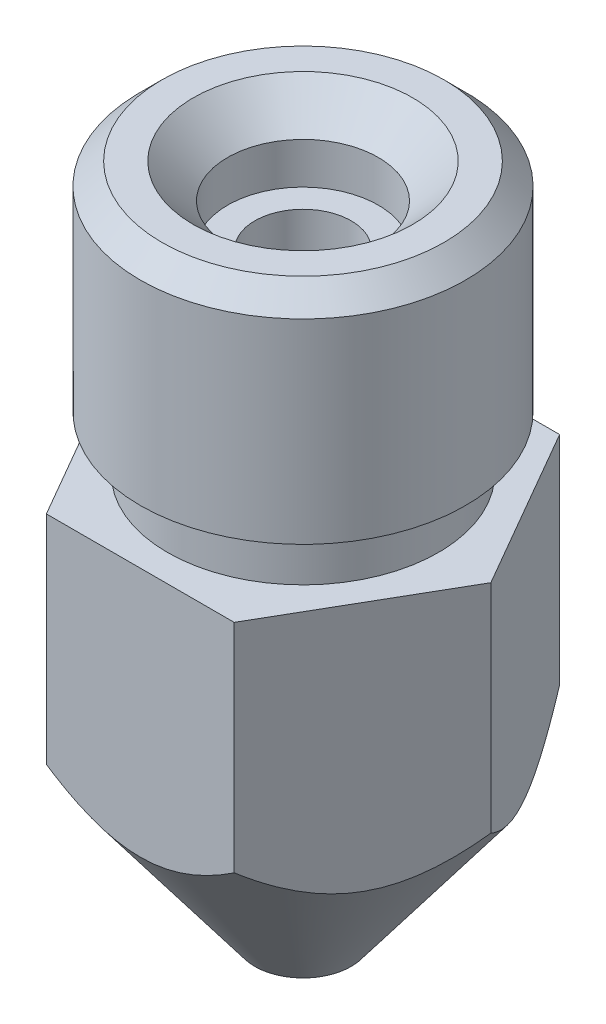
ISO-10303-21;
HEADER;
FILE_DESCRIPTION(('STEP AP214'),'2;1');
FILE_NAME('part.step','',(''),(''),'','','');
FILE_SCHEMA(('AUTOMOTIVE_DESIGN { 1 0 10303 214 1 1 1 1 }'));
ENDSEC;
DATA;
#1=APPLICATION_CONTEXT('core data for automotive mechanical design processes');
#2=APPLICATION_PROTOCOL_DEFINITION('international standard','automotive_design',2000,#1);
#3=PRODUCT_CONTEXT('',#1,'mechanical');
#4=PRODUCT('Part','Part','',(#3));
#5=PRODUCT_RELATED_PRODUCT_CATEGORY('part','',(#4));
#6=PRODUCT_DEFINITION_FORMATION('','',#4);
#7=PRODUCT_DEFINITION_CONTEXT('part definition',#1,'design');
#8=PRODUCT_DEFINITION('design','',#6,#7);
#9=PRODUCT_DEFINITION_SHAPE('','',#8);
#10=(LENGTH_UNIT() NAMED_UNIT(*) SI_UNIT(.MILLI.,.METRE.));
#11=(NAMED_UNIT(*) PLANE_ANGLE_UNIT() SI_UNIT($,.RADIAN.));
#12=(NAMED_UNIT(*) SI_UNIT($,.STERADIAN.) SOLID_ANGLE_UNIT());
#13=UNCERTAINTY_MEASURE_WITH_UNIT(LENGTH_MEASURE(1.E-05),#10,'distance_accuracy_value','');
#14=(GEOMETRIC_REPRESENTATION_CONTEXT(3) GLOBAL_UNCERTAINTY_ASSIGNED_CONTEXT((#13)) GLOBAL_UNIT_ASSIGNED_CONTEXT((#10,
#11,#12)) REPRESENTATION_CONTEXT('',''));
#15=CARTESIAN_POINT('',(0.,0.,0.));
#16=DIRECTION('',(0.,0.,1.));
#17=DIRECTION('',(1.,0.,0.));
#18=AXIS2_PLACEMENT_3D('',#15,#16,#17);
#19=CARTESIAN_POINT('',(-1.73205080756888,8.,-3.));
#20=DIRECTION('',(0.,0.,-1.));
#21=DIRECTION('',(-1.,0.,0.));
#22=AXIS2_PLACEMENT_3D('',#19,#20,#21);
#23=PLANE('',#22);
#24=DIRECTION('',(0.,-1.,0.));
#25=VECTOR('',#24,1.);
#26=CARTESIAN_POINT('',(1.73205080756888,8.,-3.));
#27=LINE('',#26,#25);
#28=CARTESIAN_POINT('',(1.73205080756888,8.,-3.));
#29=VERTEX_POINT('',#28);
#30=CARTESIAN_POINT('',(1.73205080756888,4.,-3.));
#31=VERTEX_POINT('',#30);
#32=EDGE_CURVE('E121',#29,#31,#27,.T.);
#33=ORIENTED_EDGE('',*,*,#32,.T.);
#34=CARTESIAN_POINT('',(6.82094997114173,9.29170262212918,-3.));
#35=CARTESIAN_POINT('',(6.64774401929554,9.0813350452875,-3.));
#36=CARTESIAN_POINT('',(6.47393682047476,8.87145715706887,-3.));
#37=CARTESIAN_POINT('',(6.12470232744338,8.45299574589398,-3.));
#38=CARTESIAN_POINT('',(5.94927477059046,8.24441244227294,-3.));
#39=CARTESIAN_POINT('',(5.59514693124846,7.82740350788611,-3.));
#40=CARTESIAN_POINT('',(5.41643208998841,7.61899021794126,-3.));
#41=CARTESIAN_POINT('',(5.05642425576579,7.20443416468754,-3.));
#42=CARTESIAN_POINT('',(4.87513153134106,6.9982911687951,-3.));
#43=CARTESIAN_POINT('',(4.5090672090941,6.58899526887859,-3.));
#44=CARTESIAN_POINT('',(4.3242945460733,6.38584331545606,-3.));
#45=CARTESIAN_POINT('',(3.95005740804673,5.98375586759388,-3.));
#46=CARTESIAN_POINT('',(3.76059151249946,5.78482168444988,-3.));
#47=CARTESIAN_POINT('',(3.47184219550872,5.4915442923644,-3.));
#48=CARTESIAN_POINT('',(3.37500105089817,5.394797923562,-3.));
#49=CARTESIAN_POINT('',(3.1793727340827,5.20329677499139,-3.));
#50=CARTESIAN_POINT('',(3.08058566421516,5.10854189102863,-3.));
#51=CARTESIAN_POINT('',(2.88070893905753,4.921586846251,-3.));
#52=CARTESIAN_POINT('',(2.77962046353045,4.82938542789815,-3.));
#53=CARTESIAN_POINT('',(2.57459260084723,4.64822018956895,-3.));
#54=CARTESIAN_POINT('',(2.47065366985406,4.55925585679777,-3.));
#55=CARTESIAN_POINT('',(2.28862234726129,4.4097050632151,-3.));
#56=CARTESIAN_POINT('',(2.21136888640864,4.34809943254844,-3.));
#57=CARTESIAN_POINT('',(2.05473140880651,4.22764137904479,-3.));
#58=CARTESIAN_POINT('',(1.9753473475123,4.16878901384134,-3.));
#59=CARTESIAN_POINT('',(1.81387586263798,4.05436049626195,-3.));
#60=CARTESIAN_POINT('',(1.73178097960948,3.99879480635185,-3.));
#61=CARTESIAN_POINT('',(1.56475441110359,3.89205838750722,-3.));
#62=CARTESIAN_POINT('',(1.47982257937978,3.84088788563444,-3.));
#63=CARTESIAN_POINT('',(1.30512148999752,3.74322948768255,-3.));
#64=CARTESIAN_POINT('',(1.21529060012066,3.69685062713399,-3.));
#65=CARTESIAN_POINT('',(1.03208329206091,3.61157078096566,-3.));
#66=CARTESIAN_POINT('',(0.93870650560269,3.57267057463351,-3.));
#67=CARTESIAN_POINT('',(0.749050629815442,3.50454058292605,-3.));
#68=CARTESIAN_POINT('',(0.652791806198183,3.47525534555795,-3.));
#69=CARTESIAN_POINT('',(0.457520364679528,3.42811907293071,-3.));
#70=CARTESIAN_POINT('',(0.358510342286855,3.41025761855338,-3.));
#71=CARTESIAN_POINT('',(0.19129661209742,3.39117694677446,-3.));
#72=CARTESIAN_POINT('',(0.123482172493176,3.38644420413247,-3.));
#73=CARTESIAN_POINT('',(-0.0122925148994382,3.38310881608497,-3.));
#74=CARTESIAN_POINT('',(-0.080252730712024,3.3845049412508,-3.));
#75=CARTESIAN_POINT('',(-0.215790868233687,3.39336746728049,-3.));
#76=CARTESIAN_POINT('',(-0.283368668280889,3.40083570139529,-3.));
#77=CARTESIAN_POINT('',(-0.417639206399825,3.42151185906388,-3.));
#78=CARTESIAN_POINT('',(-0.484331778551611,3.43472084338909,-3.));
#79=CARTESIAN_POINT('',(-0.638116914943697,3.47155070988845,-3.));
#80=CARTESIAN_POINT('',(-0.724732344429322,3.49716511484983,-3.));
#81=CARTESIAN_POINT('',(-0.895270909029023,3.55615252551688,-3.));
#82=CARTESIAN_POINT('',(-0.979192730374118,3.58952925366116,-3.));
#83=CARTESIAN_POINT('',(-1.14457316821897,3.66274995809633,-3.));
#84=CARTESIAN_POINT('',(-1.2260194351674,3.70262152544178,-3.));
#85=CARTESIAN_POINT('',(-1.38615382578452,3.78745481536367,-3.));
#86=CARTESIAN_POINT('',(-1.4648427647425,3.83241501640948,-3.));
#87=CARTESIAN_POINT('',(-1.68904748437283,3.96843449384525,-3.));
#88=CARTESIAN_POINT('',(-1.83136648038294,4.06474980697752,-3.));
#89=CARTESIAN_POINT('',(-2.10903000047529,4.26703537019259,-3.));
#90=CARTESIAN_POINT('',(-2.24436655611512,4.37301628516991,-3.));
#91=CARTESIAN_POINT('',(-2.51002938757712,4.59196783889417,-3.));
#92=CARTESIAN_POINT('',(-2.64033616294068,4.70496196429556,-3.));
#93=CARTESIAN_POINT('',(-2.89661185091545,4.93561866330114,-3.));
#94=CARTESIAN_POINT('',(-3.02258261954501,5.0532791918511,-3.));
#95=CARTESIAN_POINT('',(-3.2724398998665,5.29328141766935,-3.));
#96=CARTESIAN_POINT('',(-3.39629224986504,5.4156585212691,-3.));
#97=CARTESIAN_POINT('',(-3.64130266099848,5.66309338732285,-3.));
#98=CARTESIAN_POINT('',(-3.76246046963191,5.78815139886221,-3.));
#99=CARTESIAN_POINT('',(-4.00235763897061,6.04007505252968,-3.));
#100=CARTESIAN_POINT('',(-4.12110142697402,6.16693648920984,-3.));
#101=CARTESIAN_POINT('',(-4.35682577170863,6.42228877968825,-3.));
#102=CARTESIAN_POINT('',(-4.47380628932622,6.55077966951566,-3.));
#103=CARTESIAN_POINT('',(-4.78359840388089,6.89491023343037,-3.));
#104=CARTESIAN_POINT('',(-4.97512705714259,7.11170411868999,-3.));
#105=CARTESIAN_POINT('',(-5.35531077215454,7.54800288808168,-3.));
#106=CARTESIAN_POINT('',(-5.54396414685528,7.76750923658103,-3.));
#107=CARTESIAN_POINT('',(-5.91499888244514,8.2037543701068,-3.));
#108=CARTESIAN_POINT('',(-6.09742822171952,8.42045242188951,-3.));
#109=CARTESIAN_POINT('',(-6.46043597429334,8.85516029597704,-3.));
#110=CARTESIAN_POINT('',(-6.64101549182341,9.07316919552475,-3.));
#111=CARTESIAN_POINT('',(-6.82094997114173,9.29170262212918,-3.));
#112=B_SPLINE_CURVE_WITH_KNOTS('',3,(#34,#35,#36,#37,#38,#39,#40,#41,#42,#43,#44,#45,#46,#47,
#48,#49,#50,#51,#52,#53,#54,#55,#56,#57,#58,#59,#60,#61,#62,#63,#64,#65,#66,#67,#68,#69,#70,#71,
#72,#73,#74,#75,#76,#77,#78,#79,#80,#81,#82,#83,#84,#85,#86,#87,#88,#89,#90,#91,#92,#93,#94,#95,
#96,#97,#98,#99,#100,#101,#102,#103,#104,#105,#106,#107,#108,#109,#110,#111),.UNSPECIFIED.,.F.,
.F.,(4,2,2,2,2,2,2,2,2,2,2,2,2,2,2,2,2,2,2,2,2,2,2,2,2,2,2,2,2,2,2,2,2,2,2,2,2,2,4),(0.,
0.817497250943897,1.63512941951754,2.45874926772248,3.28228393908051,4.10607492636952,
4.93011838024453,5.34075811324193,5.75137630780056,6.16178854805236,6.57213548828573,
6.86851587812252,7.16490246925497,7.46218672204287,7.75948632373912,8.06250597073409,
8.36555717576264,8.66682858206701,8.96782481896387,9.17150773979527,9.3751498044386,
9.5788533741863,9.78259460013714,10.0531042518674,10.3237438955456,10.5955647695533,
10.8673045812174,11.3821597225043,11.8975899843368,12.4148507474819,12.9318872728957,
13.4541749113094,13.9765112880363,14.4977826754597,15.0190656089812,15.8868637387751,
16.7551528287155,17.6049349019683,18.4541760761938),.UNSPECIFIED.);
#113=CARTESIAN_POINT('',(-1.73205080756888,4.,-3.));
#114=VERTEX_POINT('',#113);
#115=EDGE_CURVE('E59',#31,#114,#112,.T.);
#116=ORIENTED_EDGE('',*,*,#115,.T.);
#117=DIRECTION('',(0.,-1.,0.));
#118=VECTOR('',#117,1.);
#119=CARTESIAN_POINT('',(-1.73205080756888,8.,-3.));
#120=LINE('',#119,#118);
#121=CARTESIAN_POINT('',(-1.73205080756888,8.,-3.));
#122=VERTEX_POINT('',#121);
#123=EDGE_CURVE('E133',#122,#114,#120,.T.);
#124=ORIENTED_EDGE('',*,*,#123,.F.);
#125=DIRECTION('',(1.,0.,0.));
#126=VECTOR('',#125,1.);
#127=CARTESIAN_POINT('',(-1.73205080756888,8.,-3.));
#128=LINE('',#127,#126);
#129=EDGE_CURVE('E67',#122,#29,#128,.T.);
#130=ORIENTED_EDGE('',*,*,#129,.T.);
#131=EDGE_LOOP('',(#33,#116,#124,#130));
#132=FACE_BOUND('',#131,.T.);
#133=ADVANCED_FACE('F41',(#132),#23,.T.);
#134=CARTESIAN_POINT('',(-3.46410161513776,8.,0.));
#135=DIRECTION('',(-0.866025403784439,0.,-0.5));
#136=DIRECTION('',(-0.5,0.,0.866025403784439));
#137=AXIS2_PLACEMENT_3D('',#134,#135,#136);
#138=PLANE('',#137);
#139=ORIENTED_EDGE('',*,*,#123,.T.);
#140=CARTESIAN_POINT('',(-1.73193533751504,4.00015324742413,-3.0002));
#141=CARTESIAN_POINT('',(-1.75534930525746,3.96908274657767,-2.95964581826336));
#142=CARTESIAN_POINT('',(-1.77898128501506,3.93865776909813,-2.91871402863975));
#143=CARTESIAN_POINT('',(-1.82669926792832,3.87933102671657,-2.83606405779928));
#144=CARTESIAN_POINT('',(-1.85078500621575,3.85042840843115,-2.79434633534764));
#145=CARTESIAN_POINT('',(-1.89961527422002,3.79415812078378,-2.70976983021705));
#146=CARTESIAN_POINT('',(-1.92436309848496,3.76680181692926,-2.66690534121338));
#147=CARTESIAN_POINT('',(-1.97440955294179,3.7140756490047,-2.58022233935547));
#148=CARTESIAN_POINT('',(-1.99970866799325,3.68870763184376,-2.53640298669982));
#149=CARTESIAN_POINT('',(-2.07697314141596,3.61554729494667,-2.40257699311163));
#150=CARTESIAN_POINT('',(-2.12980064257922,3.5712941467099,-2.31107707705995));
#151=CARTESIAN_POINT('',(-2.23761389587625,3.49512582464102,-2.1243390446202));
#152=CARTESIAN_POINT('',(-2.29259640127344,3.46319282102564,-2.02910655174484));
#153=CARTESIAN_POINT('',(-2.38163171109996,3.42438327904156,-1.87489287145767));
#154=CARTESIAN_POINT('',(-2.41515545508236,3.41259624939323,-1.81682804362022));
#155=CARTESIAN_POINT('',(-2.48260072236634,3.39488102028849,-1.7000094139543));
#156=CARTESIAN_POINT('',(-2.51652230154096,3.38895365399506,-1.6412555153509));
#157=CARTESIAN_POINT('',(-2.58422743046984,3.38325744364057,-1.52398679211307));
#158=CARTESIAN_POINT('',(-2.61800996344614,3.38344046740217,-1.46547372858975));
#159=CARTESIAN_POINT('',(-2.6854292015798,3.38983560718769,-1.34870018273466));
#160=CARTESIAN_POINT('',(-2.71906591153891,3.3960475231509,-1.29043969208604));
#161=CARTESIAN_POINT('',(-2.78579638303773,3.41418551677062,-1.17485912503704));
#162=CARTESIAN_POINT('',(-2.81889188768302,3.4260862067524,-1.11753602948927));
#163=CARTESIAN_POINT('',(-2.88451001288088,3.45511902367689,-1.00388210274916));
#164=CARTESIAN_POINT('',(-2.91703237060498,3.4722534878769,-0.947551726789084));
#165=CARTESIAN_POINT('',(-3.01394707402167,3.53088676686323,-0.779690536470917));
#166=CARTESIAN_POINT('',(-3.07727452028089,3.57949118311782,-0.670004182036351));
#167=CARTESIAN_POINT('',(-3.19613159119759,3.68648160419273,-0.464137696369823));
#168=CARTESIAN_POINT('',(-3.25189189215327,3.74388217203957,-0.367558022069249));
#169=CARTESIAN_POINT('',(-3.3332860556424,3.83613560061456,-0.226579195466499));
#170=CARTESIAN_POINT('',(-3.35987498104151,3.86768441277143,-0.18052582575659));
#171=CARTESIAN_POINT('',(-3.4124686692265,3.93261262169399,-0.0894308856627506));
#172=CARTESIAN_POINT('',(-3.4384737481268,3.96599099245049,-0.044388767752598));
#173=CARTESIAN_POINT('',(-3.46421708519159,4.00015324742413,0.000200000000000076));
#174=B_SPLINE_CURVE_WITH_KNOTS('',3,(#140,#141,#142,#143,#144,#145,#146,#147,#148,#149,#150,
#151,#152,#153,#154,#155,#156,#157,#158,#159,#160,#161,#162,#163,#164,#165,#166,#167,#168,#169,
#170,#171,#172,#173),.UNSPECIFIED.,.F.,.F.,(4,2,2,2,2,2,2,2,2,2,2,2,2,2,2,2,4),(0.,
0.168598179015334,0.337100819129146,0.506713452594413,0.676481815736306,1.01952427120764,
1.36206839460996,1.56606981074274,1.77010022888204,1.97252386024587,2.17494077468274,
2.37646266526227,2.57807468178434,2.98377593288444,3.35956431958675,3.54502864725949,
3.73039001072641),.UNSPECIFIED.);
#175=CARTESIAN_POINT('',(-3.46410161513776,4.,0.));
#176=VERTEX_POINT('',#175);
#177=EDGE_CURVE('E163',#114,#176,#174,.T.);
#178=ORIENTED_EDGE('',*,*,#177,.T.);
#179=DIRECTION('',(0.,-1.,0.));
#180=VECTOR('',#179,1.);
#181=CARTESIAN_POINT('',(-3.46410161513776,8.,0.));
#182=LINE('',#181,#180);
#183=CARTESIAN_POINT('',(-3.46410161513776,8.,0.));
#184=VERTEX_POINT('',#183);
#185=EDGE_CURVE('E138',#184,#176,#182,.T.);
#186=ORIENTED_EDGE('',*,*,#185,.F.);
#187=DIRECTION('',(0.5,0.,-0.866025403784439));
#188=VECTOR('',#187,1.);
#189=CARTESIAN_POINT('',(-3.46410161513776,8.,0.));
#190=LINE('',#189,#188);
#191=EDGE_CURVE('E127',#184,#122,#190,.T.);
#192=ORIENTED_EDGE('',*,*,#191,.T.);
#193=EDGE_LOOP('',(#139,#178,#186,#192));
#194=FACE_BOUND('',#193,.T.);
#195=ADVANCED_FACE('F220',(#194),#138,.T.);
#196=CARTESIAN_POINT('',(-1.73205080756888,8.,3.));
#197=DIRECTION('',(-0.866025403784439,0.,0.5));
#198=DIRECTION('',(0.5,0.,0.866025403784439));
#199=AXIS2_PLACEMENT_3D('',#196,#197,#198);
#200=PLANE('',#199);
#201=ORIENTED_EDGE('',*,*,#185,.T.);
#202=CARTESIAN_POINT('',(-3.46421708519159,4.00015324742413,-0.000200000000000257));
#203=CARTESIAN_POINT('',(-3.44080311744918,3.96908274657767,0.0403541817366424));
#204=CARTESIAN_POINT('',(-3.41717113769158,3.93865776909813,0.0812859713602484));
#205=CARTESIAN_POINT('',(-3.36945315477831,3.87933102671657,0.163935942200723));
#206=CARTESIAN_POINT('',(-3.34536741649088,3.85042840843115,0.205653664652365));
#207=CARTESIAN_POINT('',(-3.29653714848662,3.79415812078378,0.290230169782957));
#208=CARTESIAN_POINT('',(-3.27178932422167,3.76680181692926,0.333094658786627));
#209=CARTESIAN_POINT('',(-3.22174286976484,3.7140756490047,0.419777660644532));
#210=CARTESIAN_POINT('',(-3.19644375471339,3.68870763184376,0.463597013300186));
#211=CARTESIAN_POINT('',(-3.11917928129068,3.61554729494667,0.597423006888375));
#212=CARTESIAN_POINT('',(-3.06635178012741,3.5712941467099,0.68892292294005));
#213=CARTESIAN_POINT('',(-2.95853852683038,3.49512582464102,0.8756609553798));
#214=CARTESIAN_POINT('',(-2.90355602143319,3.46319282102564,0.970893448255164));
#215=CARTESIAN_POINT('',(-2.81452071160667,3.42438327904156,1.12510712854233));
#216=CARTESIAN_POINT('',(-2.78099696762427,3.41259624939323,1.18317195637978));
#217=CARTESIAN_POINT('',(-2.71355170034029,3.39488102028849,1.2999905860457));
#218=CARTESIAN_POINT('',(-2.67963012116568,3.38895365399507,1.3587444846491));
#219=CARTESIAN_POINT('',(-2.61192499223679,3.38325744364057,1.47601320788694));
#220=CARTESIAN_POINT('',(-2.57814245926049,3.38344046740217,1.53452627141025));
#221=CARTESIAN_POINT('',(-2.51072322112683,3.38983560718769,1.65129981726534));
#222=CARTESIAN_POINT('',(-2.47708651116773,3.3960475231509,1.70956030791397));
#223=CARTESIAN_POINT('',(-2.4103560396689,3.41418551677062,1.82514087496297));
#224=CARTESIAN_POINT('',(-2.37726053502361,3.4260862067524,1.88246397051073));
#225=CARTESIAN_POINT('',(-2.31164240982575,3.45511902367689,1.99611789725084));
#226=CARTESIAN_POINT('',(-2.27912005210165,3.4722534878769,2.05244827321092));
#227=CARTESIAN_POINT('',(-2.18220534868497,3.53088676686323,2.22030946352909));
#228=CARTESIAN_POINT('',(-2.11887790242574,3.57949118311782,2.32999581796365));
#229=CARTESIAN_POINT('',(-2.00002083150905,3.68648160419273,2.53586230363018));
#230=CARTESIAN_POINT('',(-1.94426053055337,3.74388217203957,2.63244197793075));
#231=CARTESIAN_POINT('',(-1.86286636706423,3.83613560061456,2.7734208045335));
#232=CARTESIAN_POINT('',(-1.83627744166513,3.86768441277143,2.81947417424341));
#233=CARTESIAN_POINT('',(-1.78368375348013,3.93261262169399,2.91056911433725));
#234=CARTESIAN_POINT('',(-1.75767867457984,3.9659909924505,2.9556112322474));
#235=CARTESIAN_POINT('',(-1.73193533751504,4.00015324742413,3.0002));
#236=B_SPLINE_CURVE_WITH_KNOTS('',3,(#202,#203,#204,#205,#206,#207,#208,#209,#210,#211,#212,
#213,#214,#215,#216,#217,#218,#219,#220,#221,#222,#223,#224,#225,#226,#227,#228,#229,#230,#231,
#232,#233,#234,#235),.UNSPECIFIED.,.F.,.F.,(4,2,2,2,2,2,2,2,2,2,2,2,2,2,2,2,4),(0.,
0.168598179015335,0.337100819129147,0.506713452594414,0.676481815736307,1.01952427120764,
1.36206839460996,1.56606981074274,1.77010022888204,1.97252386024587,2.17494077468274,
2.37646266526227,2.57807468178434,2.98377593288444,3.35956431958675,3.54502864725949,
3.73039001072641),.UNSPECIFIED.);
#237=CARTESIAN_POINT('',(-1.73205080756888,4.,3.));
#238=VERTEX_POINT('',#237);
#239=EDGE_CURVE('E161',#176,#238,#236,.T.);
#240=ORIENTED_EDGE('',*,*,#239,.T.);
#241=DIRECTION('',(0.,-1.,0.));
#242=VECTOR('',#241,1.);
#243=CARTESIAN_POINT('',(-1.73205080756888,8.,3.));
#244=LINE('',#243,#242);
#245=CARTESIAN_POINT('',(-1.73205080756888,8.,3.));
#246=VERTEX_POINT('',#245);
#247=EDGE_CURVE('E125',#246,#238,#244,.T.);
#248=ORIENTED_EDGE('',*,*,#247,.F.);
#249=DIRECTION('',(-0.5,0.,-0.866025403784439));
#250=VECTOR('',#249,1.);
#251=CARTESIAN_POINT('',(-1.73205080756888,8.,3.));
#252=LINE('',#251,#250);
#253=EDGE_CURVE('E159',#246,#184,#252,.T.);
#254=ORIENTED_EDGE('',*,*,#253,.T.);
#255=EDGE_LOOP('',(#201,#240,#248,#254));
#256=FACE_BOUND('',#255,.T.);
#257=ADVANCED_FACE('F158',(#256),#200,.T.);
#258=CARTESIAN_POINT('',(1.73205080756888,8.,3.));
#259=DIRECTION('',(0.,0.,1.));
#260=DIRECTION('',(1.,0.,0.));
#261=AXIS2_PLACEMENT_3D('',#258,#259,#260);
#262=PLANE('',#261);
#263=ORIENTED_EDGE('',*,*,#247,.T.);
#264=CARTESIAN_POINT('',(-6.82094997114173,9.29170262212918,3.));
#265=CARTESIAN_POINT('',(-6.64774401929554,9.0813350452875,3.));
#266=CARTESIAN_POINT('',(-6.47393682047476,8.87145715706887,3.));
#267=CARTESIAN_POINT('',(-6.12470232744338,8.45299574589398,3.));
#268=CARTESIAN_POINT('',(-5.94927477059046,8.24441244227294,3.));
#269=CARTESIAN_POINT('',(-5.59514693124846,7.82740350788611,3.));
#270=CARTESIAN_POINT('',(-5.41643208998841,7.61899021794126,3.));
#271=CARTESIAN_POINT('',(-5.05642425576579,7.20443416468754,3.));
#272=CARTESIAN_POINT('',(-4.87513153134106,6.9982911687951,3.));
#273=CARTESIAN_POINT('',(-4.5090672090941,6.58899526887859,3.));
#274=CARTESIAN_POINT('',(-4.3242945460733,6.38584331545606,3.));
#275=CARTESIAN_POINT('',(-3.95005740804673,5.98375586759388,3.));
#276=CARTESIAN_POINT('',(-3.76059151249946,5.78482168444988,3.));
#277=CARTESIAN_POINT('',(-3.47184219550872,5.4915442923644,3.));
#278=CARTESIAN_POINT('',(-3.37500105089817,5.39479792356201,3.));
#279=CARTESIAN_POINT('',(-3.1793727340827,5.2032967749914,3.));
#280=CARTESIAN_POINT('',(-3.08058566421517,5.10854189102863,3.));
#281=CARTESIAN_POINT('',(-2.88070893905753,4.921586846251,3.));
#282=CARTESIAN_POINT('',(-2.77962046353045,4.82938542789815,3.));
#283=CARTESIAN_POINT('',(-2.57459260084723,4.64822018956896,3.));
#284=CARTESIAN_POINT('',(-2.47065366985406,4.55925585679777,3.));
#285=CARTESIAN_POINT('',(-2.28862234726129,4.4097050632151,3.));
#286=CARTESIAN_POINT('',(-2.21136888640864,4.34809943254844,3.));
#287=CARTESIAN_POINT('',(-2.05473140880651,4.22764137904479,3.));
#288=CARTESIAN_POINT('',(-1.9753473475123,4.16878901384134,3.));
#289=CARTESIAN_POINT('',(-1.81387586263798,4.05436049626195,3.));
#290=CARTESIAN_POINT('',(-1.73178097960948,3.99879480635185,3.));
#291=CARTESIAN_POINT('',(-1.56475441110359,3.89205838750722,3.));
#292=CARTESIAN_POINT('',(-1.47982257937978,3.84088788563445,3.));
#293=CARTESIAN_POINT('',(-1.30512148999753,3.74322948768255,3.));
#294=CARTESIAN_POINT('',(-1.21529060012066,3.69685062713399,3.));
#295=CARTESIAN_POINT('',(-1.03208329206091,3.61157078096566,3.));
#296=CARTESIAN_POINT('',(-0.938706505602692,3.57267057463351,3.));
#297=CARTESIAN_POINT('',(-0.749050629815443,3.50454058292605,3.));
#298=CARTESIAN_POINT('',(-0.652791806198184,3.47525534555795,3.));
#299=CARTESIAN_POINT('',(-0.457520364679529,3.42811907293071,3.));
#300=CARTESIAN_POINT('',(-0.358510342286856,3.41025761855338,3.));
#301=CARTESIAN_POINT('',(-0.191296612097421,3.39117694677446,3.));
#302=CARTESIAN_POINT('',(-0.123482172493178,3.38644420413247,3.));
#303=CARTESIAN_POINT('',(0.012292514899437,3.38310881608497,3.));
#304=CARTESIAN_POINT('',(0.0802527307120229,3.3845049412508,3.));
#305=CARTESIAN_POINT('',(0.215790868233686,3.39336746728049,3.));
#306=CARTESIAN_POINT('',(0.283368668280889,3.40083570139529,3.));
#307=CARTESIAN_POINT('',(0.417639206399825,3.42151185906388,3.));
#308=CARTESIAN_POINT('',(0.484331778551611,3.43472084338909,3.));
#309=CARTESIAN_POINT('',(0.638116914943696,3.47155070988845,3.));
#310=CARTESIAN_POINT('',(0.724732344429322,3.49716511484983,3.));
#311=CARTESIAN_POINT('',(0.895270909029023,3.55615252551688,3.));
#312=CARTESIAN_POINT('',(0.979192730374118,3.58952925366116,3.));
#313=CARTESIAN_POINT('',(1.14457316821897,3.66274995809633,3.));
#314=CARTESIAN_POINT('',(1.22601943516739,3.70262152544178,3.));
#315=CARTESIAN_POINT('',(1.38615382578452,3.78745481536367,3.));
#316=CARTESIAN_POINT('',(1.4648427647425,3.83241501640948,3.));
#317=CARTESIAN_POINT('',(1.68904748437283,3.96843449384525,3.));
#318=CARTESIAN_POINT('',(1.83136648038294,4.06474980697752,3.));
#319=CARTESIAN_POINT('',(2.10903000047529,4.26703537019259,3.));
#320=CARTESIAN_POINT('',(2.24436655611512,4.37301628516991,3.));
#321=CARTESIAN_POINT('',(2.51002938757712,4.59196783889417,3.));
#322=CARTESIAN_POINT('',(2.64033616294068,4.70496196429555,3.));
#323=CARTESIAN_POINT('',(2.89661185091544,4.93561866330113,3.));
#324=CARTESIAN_POINT('',(3.02258261954501,5.05327919185109,3.));
#325=CARTESIAN_POINT('',(3.27243989986649,5.29328141766935,3.));
#326=CARTESIAN_POINT('',(3.39629224986504,5.4156585212691,3.));
#327=CARTESIAN_POINT('',(3.64130266099847,5.66309338732285,3.));
#328=CARTESIAN_POINT('',(3.76246046963191,5.7881513988622,3.));
#329=CARTESIAN_POINT('',(4.0023576389706,6.04007505252968,3.));
#330=CARTESIAN_POINT('',(4.12110142697402,6.16693648920984,3.));
#331=CARTESIAN_POINT('',(4.35682577170863,6.42228877968825,3.));
#332=CARTESIAN_POINT('',(4.47380628932622,6.55077966951566,3.));
#333=CARTESIAN_POINT('',(4.78359840388088,6.89491023343037,3.));
#334=CARTESIAN_POINT('',(4.97512705714259,7.11170411868998,3.));
#335=CARTESIAN_POINT('',(5.35531077215454,7.54800288808168,3.));
#336=CARTESIAN_POINT('',(5.54396414685528,7.76750923658103,3.));
#337=CARTESIAN_POINT('',(5.91499888244514,8.2037543701068,3.));
#338=CARTESIAN_POINT('',(6.09742822171952,8.42045242188951,3.));
#339=CARTESIAN_POINT('',(6.46043597429334,8.85516029597704,3.));
#340=CARTESIAN_POINT('',(6.64101549182342,9.07316919552475,3.));
#341=CARTESIAN_POINT('',(6.82094997114173,9.29170262212918,3.));
#342=B_SPLINE_CURVE_WITH_KNOTS('',3,(#264,#265,#266,#267,#268,#269,#270,#271,#272,#273,#274,
#275,#276,#277,#278,#279,#280,#281,#282,#283,#284,#285,#286,#287,#288,#289,#290,#291,#292,#293,
#294,#295,#296,#297,#298,#299,#300,#301,#302,#303,#304,#305,#306,#307,#308,#309,#310,#311,#312,
#313,#314,#315,#316,#317,#318,#319,#320,#321,#322,#323,#324,#325,#326,#327,#328,#329,#330,#331,
#332,#333,#334,#335,#336,#337,#338,#339,#340,#341),.UNSPECIFIED.,.F.,.F.,(4,2,2,2,2,2,2,2,2,2,2,
2,2,2,2,2,2,2,2,2,2,2,2,2,2,2,2,2,2,2,2,2,2,2,2,2,2,2,4),(0.,0.817497250943897,1.63512941951754,
2.45874926772248,3.28228393908051,4.10607492636951,4.93011838024452,5.34075811324193,
5.75137630780056,6.16178854805236,6.57213548828573,6.86851587812252,7.16490246925497,
7.46218672204287,7.75948632373912,8.06250597073409,8.36555717576264,8.66682858206701,
8.96782481896387,9.17150773979527,9.3751498044386,9.57885337418631,9.78259460013714,
10.0531042518674,10.3237438955456,10.5955647695533,10.8673045812174,11.3821597225043,
11.8975899843368,12.4148507474819,12.9318872728957,13.4541749113094,13.9765112880363,
14.4977826754596,15.0190656089812,15.886863738775,16.7551528287155,17.6049349019683,
18.4541760761938),.UNSPECIFIED.);
#343=CARTESIAN_POINT('',(1.73205080756888,4.,3.));
#344=VERTEX_POINT('',#343);
#345=EDGE_CURVE('E115',#238,#344,#342,.T.);
#346=ORIENTED_EDGE('',*,*,#345,.T.);
#347=DIRECTION('',(0.,-1.,0.));
#348=VECTOR('',#347,1.);
#349=CARTESIAN_POINT('',(1.73205080756888,8.,3.));
#350=LINE('',#349,#348);
#351=CARTESIAN_POINT('',(1.73205080756888,8.,3.));
#352=VERTEX_POINT('',#351);
#353=EDGE_CURVE('E113',#352,#344,#350,.T.);
#354=ORIENTED_EDGE('',*,*,#353,.F.);
#355=DIRECTION('',(-1.,0.,0.));
#356=VECTOR('',#355,1.);
#357=CARTESIAN_POINT('',(1.73205080756888,8.,3.));
#358=LINE('',#357,#356);
#359=EDGE_CURVE('E154',#352,#246,#358,.T.);
#360=ORIENTED_EDGE('',*,*,#359,.T.);
#361=EDGE_LOOP('',(#263,#346,#354,#360));
#362=FACE_BOUND('',#361,.T.);
#363=ADVANCED_FACE('F153',(#362),#262,.T.);
#364=CARTESIAN_POINT('',(3.46410161513775,8.,0.));
#365=DIRECTION('',(0.866025403784439,0.,0.5));
#366=DIRECTION('',(0.5,0.,-0.866025403784439));
#367=AXIS2_PLACEMENT_3D('',#364,#365,#366);
#368=PLANE('',#367);
#369=ORIENTED_EDGE('',*,*,#353,.T.);
#370=CARTESIAN_POINT('',(1.73193533751504,4.00015324742413,3.0002));
#371=CARTESIAN_POINT('',(1.75534930525745,3.96908274657767,2.95964581826336));
#372=CARTESIAN_POINT('',(1.77898128501506,3.93865776909813,2.91871402863975));
#373=CARTESIAN_POINT('',(1.82669926792832,3.87933102671657,2.83606405779928));
#374=CARTESIAN_POINT('',(1.85078500621575,3.85042840843115,2.79434633534764));
#375=CARTESIAN_POINT('',(1.89961527422002,3.79415812078378,2.70976983021705));
#376=CARTESIAN_POINT('',(1.92436309848496,3.76680181692926,2.66690534121338));
#377=CARTESIAN_POINT('',(1.97440955294179,3.7140756490047,2.58022233935547));
#378=CARTESIAN_POINT('',(1.99970866799324,3.68870763184376,2.53640298669982));
#379=CARTESIAN_POINT('',(2.07697314141596,3.61554729494667,2.40257699311163));
#380=CARTESIAN_POINT('',(2.12980064257922,3.5712941467099,2.31107707705995));
#381=CARTESIAN_POINT('',(2.23761389587625,3.49512582464102,2.1243390446202));
#382=CARTESIAN_POINT('',(2.29259640127344,3.46319282102564,2.02910655174484));
#383=CARTESIAN_POINT('',(2.38163171109996,3.42438327904156,1.87489287145767));
#384=CARTESIAN_POINT('',(2.41515545508236,3.41259624939323,1.81682804362022));
#385=CARTESIAN_POINT('',(2.48260072236634,3.39488102028849,1.7000094139543));
#386=CARTESIAN_POINT('',(2.51652230154096,3.38895365399506,1.6412555153509));
#387=CARTESIAN_POINT('',(2.58422743046984,3.38325744364057,1.52398679211306));
#388=CARTESIAN_POINT('',(2.61800996344614,3.38344046740217,1.46547372858975));
#389=CARTESIAN_POINT('',(2.6854292015798,3.38983560718769,1.34870018273466));
#390=CARTESIAN_POINT('',(2.71906591153891,3.3960475231509,1.29043969208603));
#391=CARTESIAN_POINT('',(2.78579638303773,3.41418551677062,1.17485912503704));
#392=CARTESIAN_POINT('',(2.81889188768302,3.4260862067524,1.11753602948927));
#393=CARTESIAN_POINT('',(2.88451001288088,3.45511902367689,1.00388210274916));
#394=CARTESIAN_POINT('',(2.91703237060498,3.4722534878769,0.947551726789083));
#395=CARTESIAN_POINT('',(3.01394707402167,3.53088676686323,0.779690536470916));
#396=CARTESIAN_POINT('',(3.07727452028089,3.57949118311782,0.67000418203635));
#397=CARTESIAN_POINT('',(3.19613159119759,3.68648160419273,0.464137696369822));
#398=CARTESIAN_POINT('',(3.25189189215327,3.74388217203957,0.367558022069248));
#399=CARTESIAN_POINT('',(3.3332860556424,3.83613560061455,0.226579195466499));
#400=CARTESIAN_POINT('',(3.35987498104151,3.86768441277143,0.180525825756591));
#401=CARTESIAN_POINT('',(3.4124686692265,3.93261262169399,0.0894308856627519));
#402=CARTESIAN_POINT('',(3.4384737481268,3.96599099245049,0.0443887677525996));
#403=CARTESIAN_POINT('',(3.46421708519159,4.00015324742413,-0.000199999999998396));
#404=B_SPLINE_CURVE_WITH_KNOTS('',3,(#370,#371,#372,#373,#374,#375,#376,#377,#378,#379,#380,
#381,#382,#383,#384,#385,#386,#387,#388,#389,#390,#391,#392,#393,#394,#395,#396,#397,#398,#399,
#400,#401,#402,#403),.UNSPECIFIED.,.F.,.F.,(4,2,2,2,2,2,2,2,2,2,2,2,2,2,2,2,4),(0.,
0.168598179015335,0.337100819129148,0.506713452594413,0.676481815736307,1.01952427120764,
1.36206839460996,1.56606981074275,1.77010022888205,1.97252386024587,2.17494077468274,
2.37646266526228,2.57807468178434,2.98377593288444,3.35956431958675,3.54502864725949,
3.73039001072641),.UNSPECIFIED.);
#405=CARTESIAN_POINT('',(3.46410161513776,4.,0.));
#406=VERTEX_POINT('',#405);
#407=EDGE_CURVE('E97',#344,#406,#404,.T.);
#408=ORIENTED_EDGE('',*,*,#407,.T.);
#409=DIRECTION('',(0.,-1.,0.));
#410=VECTOR('',#409,1.);
#411=CARTESIAN_POINT('',(3.46410161513775,8.,0.));
#412=LINE('',#411,#410);
#413=CARTESIAN_POINT('',(3.46410161513775,8.,0.));
#414=VERTEX_POINT('',#413);
#415=EDGE_CURVE('E111',#414,#406,#412,.T.);
#416=ORIENTED_EDGE('',*,*,#415,.F.);
#417=DIRECTION('',(-0.5,0.,0.866025403784439));
#418=VECTOR('',#417,1.);
#419=CARTESIAN_POINT('',(3.46410161513775,8.,0.));
#420=LINE('',#419,#418);
#421=EDGE_CURVE('E233',#414,#352,#420,.T.);
#422=ORIENTED_EDGE('',*,*,#421,.T.);
#423=EDGE_LOOP('',(#369,#408,#416,#422));
#424=FACE_BOUND('',#423,.T.);
#425=ADVANCED_FACE('F109',(#424),#368,.T.);
#426=CARTESIAN_POINT('',(1.73205080756888,8.,-3.));
#427=DIRECTION('',(0.866025403784439,0.,-0.5));
#428=DIRECTION('',(-0.5,0.,-0.866025403784439));
#429=AXIS2_PLACEMENT_3D('',#426,#427,#428);
#430=PLANE('',#429);
#431=ORIENTED_EDGE('',*,*,#415,.T.);
#432=CARTESIAN_POINT('',(3.46421708519159,4.00015324742413,0.000200000000001464));
#433=CARTESIAN_POINT('',(3.44080311744918,3.96908274657767,-0.0403541817366418));
#434=CARTESIAN_POINT('',(3.41717113769157,3.93865776909813,-0.0812859713602479));
#435=CARTESIAN_POINT('',(3.36945315477831,3.87933102671657,-0.163935942200722));
#436=CARTESIAN_POINT('',(3.34536741649088,3.85042840843114,-0.205653664652364));
#437=CARTESIAN_POINT('',(3.29653714848661,3.79415812078378,-0.290230169782956));
#438=CARTESIAN_POINT('',(3.27178932422167,3.76680181692925,-0.333094658786626));
#439=CARTESIAN_POINT('',(3.22174286976484,3.7140756490047,-0.419777660644531));
#440=CARTESIAN_POINT('',(3.19644375471339,3.68870763184376,-0.463597013300185));
#441=CARTESIAN_POINT('',(3.11917928129068,3.61554729494667,-0.597423006888375));
#442=CARTESIAN_POINT('',(3.06635178012741,3.5712941467099,-0.688922922940049));
#443=CARTESIAN_POINT('',(2.95853852683038,3.49512582464101,-0.875660955379799));
#444=CARTESIAN_POINT('',(2.90355602143319,3.46319282102564,-0.970893448255164));
#445=CARTESIAN_POINT('',(2.81452071160667,3.42438327904156,-1.12510712854233));
#446=CARTESIAN_POINT('',(2.78099696762427,3.41259624939323,-1.18317195637978));
#447=CARTESIAN_POINT('',(2.71355170034029,3.39488102028848,-1.2999905860457));
#448=CARTESIAN_POINT('',(2.67963012116568,3.38895365399506,-1.3587444846491));
#449=CARTESIAN_POINT('',(2.61192499223679,3.38325744364057,-1.47601320788694));
#450=CARTESIAN_POINT('',(2.57814245926049,3.38344046740217,-1.53452627141025));
#451=CARTESIAN_POINT('',(2.51072322112683,3.38983560718769,-1.65129981726534));
#452=CARTESIAN_POINT('',(2.47708651116773,3.3960475231509,-1.70956030791397));
#453=CARTESIAN_POINT('',(2.4103560396689,3.41418551677062,-1.82514087496296));
#454=CARTESIAN_POINT('',(2.37726053502361,3.4260862067524,-1.88246397051073));
#455=CARTESIAN_POINT('',(2.31164240982575,3.45511902367689,-1.99611789725084));
#456=CARTESIAN_POINT('',(2.27912005210165,3.4722534878769,-2.05244827321092));
#457=CARTESIAN_POINT('',(2.18220534868496,3.53088676686323,-2.22030946352908));
#458=CARTESIAN_POINT('',(2.11887790242574,3.57949118311782,-2.32999581796365));
#459=CARTESIAN_POINT('',(2.00002083150905,3.68648160419273,-2.53586230363018));
#460=CARTESIAN_POINT('',(1.94426053055336,3.74388217203957,-2.63244197793075));
#461=CARTESIAN_POINT('',(1.86286636706423,3.83613560061455,-2.7734208045335));
#462=CARTESIAN_POINT('',(1.83627744166512,3.86768441277143,-2.81947417424341));
#463=CARTESIAN_POINT('',(1.78368375348013,3.93261262169399,-2.91056911433725));
#464=CARTESIAN_POINT('',(1.75767867457984,3.96599099245049,-2.9556112322474));
#465=CARTESIAN_POINT('',(1.73193533751504,4.00015324742413,-3.0002));
#466=B_SPLINE_CURVE_WITH_KNOTS('',3,(#432,#433,#434,#435,#436,#437,#438,#439,#440,#441,#442,
#443,#444,#445,#446,#447,#448,#449,#450,#451,#452,#453,#454,#455,#456,#457,#458,#459,#460,#461,
#462,#463,#464,#465),.UNSPECIFIED.,.F.,.F.,(4,2,2,2,2,2,2,2,2,2,2,2,2,2,2,2,4),(0.,
0.168598179015335,0.337100819129148,0.506713452594415,0.676481815736308,1.01952427120764,
1.36206839460996,1.56606981074274,1.77010022888204,1.97252386024587,2.17494077468274,
2.37646266526227,2.57807468178434,2.98377593288444,3.35956431958675,3.54502864725949,
3.73039001072641),.UNSPECIFIED.);
#467=EDGE_CURVE('E94',#406,#31,#466,.T.);
#468=ORIENTED_EDGE('',*,*,#467,.T.);
#469=ORIENTED_EDGE('',*,*,#32,.F.);
#470=DIRECTION('',(0.5,0.,0.866025403784439));
#471=VECTOR('',#470,1.);
#472=CARTESIAN_POINT('',(1.73205080756888,8.,-3.));
#473=LINE('',#472,#471);
#474=EDGE_CURVE('E119',#29,#414,#473,.T.);
#475=ORIENTED_EDGE('',*,*,#474,.T.);
#476=EDGE_LOOP('',(#431,#468,#469,#475));
#477=FACE_BOUND('',#476,.T.);
#478=ADVANCED_FACE('F118',(#477),#430,.T.);
#479=CARTESIAN_POINT('',(0.,8.,0.));
#480=DIRECTION('',(0.,-1.,0.));
#481=DIRECTION('',(0.,0.,-1.));
#482=AXIS2_PLACEMENT_3D('',#479,#480,#481);
#483=PLANE('',#482);
#484=ORIENTED_EDGE('',*,*,#129,.F.);
#485=ORIENTED_EDGE('',*,*,#191,.F.);
#486=ORIENTED_EDGE('',*,*,#253,.F.);
#487=ORIENTED_EDGE('',*,*,#359,.F.);
#488=ORIENTED_EDGE('',*,*,#421,.F.);
#489=ORIENTED_EDGE('',*,*,#474,.F.);
#490=EDGE_LOOP('',(#484,#485,#486,#487,#488,#489));
#491=FACE_BOUND('',#490,.T.);
#492=CARTESIAN_POINT('',(0.,8.,0.));
#493=DIRECTION('',(0.,1.,0.));
#494=DIRECTION('',(0.,0.,1.));
#495=AXIS2_PLACEMENT_3D('',#492,#493,#494);
#496=CIRCLE('',#495,2.5);
#497=CARTESIAN_POINT('',(0.,8.,2.5));
#498=VERTEX_POINT('',#497);
#499=EDGE_CURVE('E243',#498,#498,#496,.T.);
#500=ORIENTED_EDGE('',*,*,#499,.F.);
#501=EDGE_LOOP('',(#500));
#502=FACE_BOUND('',#501,.T.);
#503=ADVANCED_FACE('F192',(#491,#502),#483,.F.);
#504=CARTESIAN_POINT('',(0.,0.,0.));
#505=DIRECTION('',(0.,1.,0.));
#506=DIRECTION('',(0.,0.,1.));
#507=AXIS2_PLACEMENT_3D('',#504,#505,#506);
#508=CONICAL_SURFACE('',#507,0.45,0.645753551829437);
#509=CARTESIAN_POINT('',(0.,0.58259482400355,0.));
#510=DIRECTION('',(0.,1.,0.));
#511=DIRECTION('',(0.,0.,1.));
#512=AXIS2_PLACEMENT_3D('',#509,#510,#511);
#513=CIRCLE('',#512,0.888999999999999);
#514=CARTESIAN_POINT('',(0.,0.58259482400355,0.888999999999999));
#515=VERTEX_POINT('',#514);
#516=EDGE_CURVE('E46',#515,#515,#513,.F.);
#517=ORIENTED_EDGE('',*,*,#516,.F.);
#518=EDGE_LOOP('',(#517));
#519=FACE_BOUND('',#518,.T.);
#520=ORIENTED_EDGE('',*,*,#467,.F.);
#521=ORIENTED_EDGE('',*,*,#407,.F.);
#522=ORIENTED_EDGE('',*,*,#345,.F.);
#523=ORIENTED_EDGE('',*,*,#239,.F.);
#524=ORIENTED_EDGE('',*,*,#177,.F.);
#525=ORIENTED_EDGE('',*,*,#115,.F.);
#526=EDGE_LOOP('',(#520,#521,#522,#523,#524,#525));
#527=FACE_BOUND('',#526,.T.);
#528=ADVANCED_FACE('F96',(#519,#527),#508,.T.);
#529=CARTESIAN_POINT('',(0.,9.,0.));
#530=DIRECTION('',(0.,1.,0.));
#531=DIRECTION('',(0.,0.,1.));
#532=AXIS2_PLACEMENT_3D('',#529,#530,#531);
#533=PLANE('',#532);
#534=CARTESIAN_POINT('',(0.,9.,0.));
#535=DIRECTION('',(0.,1.,0.));
#536=DIRECTION('',(0.,0.,1.));
#537=AXIS2_PLACEMENT_3D('',#534,#535,#536);
#538=CIRCLE('',#537,3.);
#539=CARTESIAN_POINT('',(0.,9.,3.));
#540=VERTEX_POINT('',#539);
#541=EDGE_CURVE('E104',#540,#540,#538,.T.);
#542=ORIENTED_EDGE('',*,*,#541,.F.);
#543=EDGE_LOOP('',(#542));
#544=FACE_BOUND('',#543,.T.);
#545=CARTESIAN_POINT('',(0.,9.,0.));
#546=DIRECTION('',(0.,1.,0.));
#547=DIRECTION('',(0.,0.,1.));
#548=AXIS2_PLACEMENT_3D('',#545,#546,#547);
#549=CIRCLE('',#548,2.5);
#550=CARTESIAN_POINT('',(0.,9.,2.5));
#551=VERTEX_POINT('',#550);
#552=EDGE_CURVE('E246',#551,#551,#549,.T.);
#553=ORIENTED_EDGE('',*,*,#552,.T.);
#554=EDGE_LOOP('',(#553));
#555=FACE_BOUND('',#554,.T.);
#556=ADVANCED_FACE('F191',(#544,#555),#533,.F.);
#557=CARTESIAN_POINT('',(0.,9.,0.));
#558=DIRECTION('',(0.,-1.,0.));
#559=DIRECTION('',(0.,0.,-1.));
#560=AXIS2_PLACEMENT_3D('',#557,#558,#559);
#561=CYLINDRICAL_SURFACE('',#560,2.5);
#562=ORIENTED_EDGE('',*,*,#552,.F.);
#563=EDGE_LOOP('',(#562));
#564=FACE_BOUND('',#563,.T.);
#565=ORIENTED_EDGE('',*,*,#499,.T.);
#566=EDGE_LOOP('',(#565));
#567=FACE_BOUND('',#566,.T.);
#568=ADVANCED_FACE('F263',(#564,#567),#561,.T.);
#569=CARTESIAN_POINT('',(0.,13.,0.));
#570=DIRECTION('',(0.,1.,0.));
#571=DIRECTION('',(0.,0.,1.));
#572=AXIS2_PLACEMENT_3D('',#569,#570,#571);
#573=PLANE('',#572);
#574=CARTESIAN_POINT('',(0.,13.,0.));
#575=DIRECTION('',(0.,1.,0.));
#576=DIRECTION('',(0.,0.,1.));
#577=AXIS2_PLACEMENT_3D('',#574,#575,#576);
#578=CIRCLE('',#577,2.02438);
#579=CARTESIAN_POINT('',(0.,13.,2.02438));
#580=VERTEX_POINT('',#579);
#581=EDGE_CURVE('E295',#580,#580,#578,.T.);
#582=ORIENTED_EDGE('',*,*,#581,.F.);
#583=EDGE_LOOP('',(#582));
#584=FACE_BOUND('',#583,.T.);
#585=CARTESIAN_POINT('',(0.,13.,0.));
#586=DIRECTION('',(0.,1.,0.));
#587=DIRECTION('',(0.,0.,1.));
#588=AXIS2_PLACEMENT_3D('',#585,#586,#587);
#589=CIRCLE('',#588,2.60000000000001);
#590=CARTESIAN_POINT('',(0.,13.,2.60000000000001));
#591=VERTEX_POINT('',#590);
#592=EDGE_CURVE('E52',#591,#591,#589,.T.);
#593=ORIENTED_EDGE('',*,*,#592,.T.);
#594=EDGE_LOOP('',(#593));
#595=FACE_BOUND('',#594,.T.);
#596=ADVANCED_FACE('F222',(#584,#595),#573,.T.);
#597=CARTESIAN_POINT('',(0.,13.,0.));
#598=DIRECTION('',(0.,-1.,0.));
#599=DIRECTION('',(0.,0.,-1.));
#600=AXIS2_PLACEMENT_3D('',#597,#598,#599);
#601=CYLINDRICAL_SURFACE('',#600,3.);
#602=CARTESIAN_POINT('',(0.,12.6,0.));
#603=DIRECTION('',(0.,1.,0.));
#604=DIRECTION('',(0.,0.,1.));
#605=AXIS2_PLACEMENT_3D('',#602,#603,#604);
#606=CIRCLE('',#605,3.);
#607=CARTESIAN_POINT('',(0.,12.6,3.));
#608=VERTEX_POINT('',#607);
#609=EDGE_CURVE('E11',#608,#608,#606,.F.);
#610=ORIENTED_EDGE('',*,*,#609,.T.);
#611=EDGE_LOOP('',(#610));
#612=FACE_BOUND('',#611,.T.);
#613=ORIENTED_EDGE('',*,*,#541,.T.);
#614=EDGE_LOOP('',(#613));
#615=FACE_BOUND('',#614,.T.);
#616=ADVANCED_FACE('F259',(#612,#615),#601,.T.);
#617=CARTESIAN_POINT('',(0.,13.,0.));
#618=DIRECTION('',(0.,-1.,0.));
#619=DIRECTION('',(0.,0.,-1.));
#620=AXIS2_PLACEMENT_3D('',#617,#618,#619);
#621=CONICAL_SURFACE('',#620,2.60000000000001,0.785398163397446);
#622=ORIENTED_EDGE('',*,*,#609,.F.);
#623=EDGE_LOOP('',(#622));
#624=FACE_BOUND('',#623,.T.);
#625=ORIENTED_EDGE('',*,*,#592,.F.);
#626=EDGE_LOOP('',(#625));
#627=FACE_BOUND('',#626,.T.);
#628=ADVANCED_FACE('F44',(#624,#627),#621,.T.);
#629=CARTESIAN_POINT('',(0.,13.,0.));
#630=DIRECTION('',(0.,1.,0.));
#631=DIRECTION('',(0.,0.,1.));
#632=AXIS2_PLACEMENT_3D('',#629,#630,#631);
#633=CYLINDRICAL_SURFACE('',#632,0.888999999999999);
#634=ORIENTED_EDGE('',*,*,#516,.T.);
#635=EDGE_LOOP('',(#634));
#636=FACE_BOUND('',#635,.T.);
#637=CARTESIAN_POINT('',(0.,11.603,0.));
#638=DIRECTION('',(0.,1.,0.));
#639=DIRECTION('',(0.,0.,1.));
#640=AXIS2_PLACEMENT_3D('',#637,#638,#639);
#641=CIRCLE('',#640,0.889000000000001);
#642=CARTESIAN_POINT('',(0.,11.603,0.889000000000001));
#643=VERTEX_POINT('',#642);
#644=EDGE_CURVE('E253',#643,#643,#641,.T.);
#645=ORIENTED_EDGE('',*,*,#644,.T.);
#646=EDGE_LOOP('',(#645));
#647=FACE_BOUND('',#646,.T.);
#648=ADVANCED_FACE('F272',(#636,#647),#633,.F.);
#649=CARTESIAN_POINT('',(1.38938,11.603,0.));
#650=DIRECTION('',(0.,-1.,0.));
#651=DIRECTION('',(0.,0.,-1.));
#652=AXIS2_PLACEMENT_3D('',#649,#650,#651);
#653=PLANE('',#652);
#654=ORIENTED_EDGE('',*,*,#644,.F.);
#655=EDGE_LOOP('',(#654));
#656=FACE_BOUND('',#655,.T.);
#657=CARTESIAN_POINT('',(0.,11.603,0.));
#658=DIRECTION('',(0.,1.,0.));
#659=DIRECTION('',(0.,0.,1.));
#660=AXIS2_PLACEMENT_3D('',#657,#658,#659);
#661=CIRCLE('',#660,1.38938);
#662=CARTESIAN_POINT('',(0.,11.603,1.38938));
#663=VERTEX_POINT('',#662);
#664=EDGE_CURVE('E299',#663,#663,#661,.T.);
#665=ORIENTED_EDGE('',*,*,#664,.T.);
#666=EDGE_LOOP('',(#665));
#667=FACE_BOUND('',#666,.T.);
#668=ADVANCED_FACE('F275',(#656,#667),#653,.F.);
#669=CARTESIAN_POINT('',(0.,13.,0.));
#670=DIRECTION('',(0.,1.,0.));
#671=DIRECTION('',(0.,0.,1.));
#672=AXIS2_PLACEMENT_3D('',#669,#670,#671);
#673=CYLINDRICAL_SURFACE('',#672,1.38938);
#674=ORIENTED_EDGE('',*,*,#664,.F.);
#675=EDGE_LOOP('',(#674));
#676=FACE_BOUND('',#675,.T.);
#677=CARTESIAN_POINT('',(0.,12.365,0.));
#678=DIRECTION('',(0.,1.,0.));
#679=DIRECTION('',(0.,0.,1.));
#680=AXIS2_PLACEMENT_3D('',#677,#678,#679);
#681=CIRCLE('',#680,1.38938);
#682=CARTESIAN_POINT('',(0.,12.365,1.38938));
#683=VERTEX_POINT('',#682);
#684=EDGE_CURVE('E292',#683,#683,#681,.T.);
#685=ORIENTED_EDGE('',*,*,#684,.T.);
#686=EDGE_LOOP('',(#685));
#687=FACE_BOUND('',#686,.T.);
#688=ADVANCED_FACE('F279',(#676,#687),#673,.F.);
#689=CARTESIAN_POINT('',(0.,13.,0.));
#690=DIRECTION('',(0.,1.,0.));
#691=DIRECTION('',(0.,0.,1.));
#692=AXIS2_PLACEMENT_3D('',#689,#690,#691);
#693=CONICAL_SURFACE('',#692,2.02438,0.785398163397449);
#694=ORIENTED_EDGE('',*,*,#684,.F.);
#695=EDGE_LOOP('',(#694));
#696=FACE_BOUND('',#695,.T.);
#697=ORIENTED_EDGE('',*,*,#581,.T.);
#698=EDGE_LOOP('',(#697));
#699=FACE_BOUND('',#698,.T.);
#700=ADVANCED_FACE('F283',(#696,#699),#693,.F.);
#701=CLOSED_SHELL('',(#133,#195,#257,#363,#425,#478,#503,#528,#556,#568,#596,#616,#628,#648,
#668,#688,#700));
#702=MANIFOLD_SOLID_BREP('B2',#701);
#703=ADVANCED_BREP_SHAPE_REPRESENTATION('',(#18,#702),#14);
#704=SHAPE_DEFINITION_REPRESENTATION(#9,#703);
ENDSEC;
END-ISO-10303-21;
